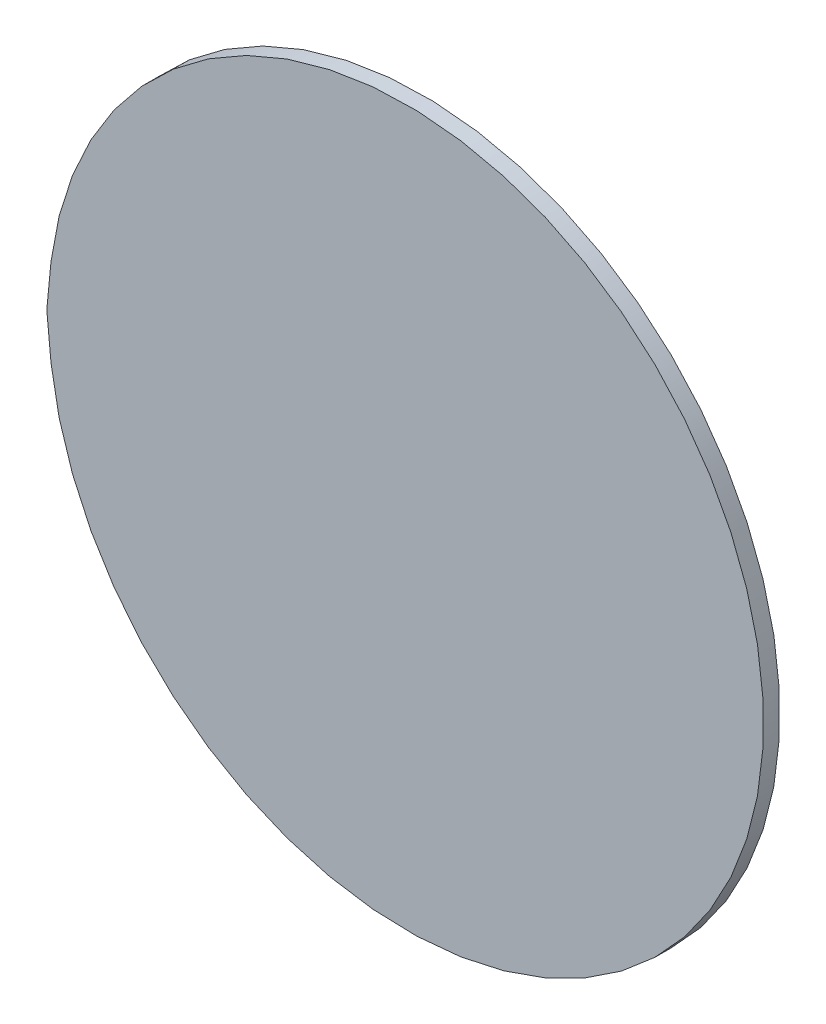
ISO-10303-21;
HEADER;
FILE_DESCRIPTION(('STEP AP214'),'2;1');
FILE_NAME('part.step','',(''),(''),'','','');
FILE_SCHEMA(('AUTOMOTIVE_DESIGN { 1 0 10303 214 1 1 1 1 }'));
ENDSEC;
DATA;
#1=APPLICATION_CONTEXT('core data for automotive mechanical design processes');
#2=APPLICATION_PROTOCOL_DEFINITION('international standard','automotive_design',2000,#1);
#3=PRODUCT_CONTEXT('',#1,'mechanical');
#4=PRODUCT('Part','Part','',(#3));
#5=PRODUCT_RELATED_PRODUCT_CATEGORY('part','',(#4));
#6=PRODUCT_DEFINITION_FORMATION('','',#4);
#7=PRODUCT_DEFINITION_CONTEXT('part definition',#1,'design');
#8=PRODUCT_DEFINITION('design','',#6,#7);
#9=PRODUCT_DEFINITION_SHAPE('','',#8);
#10=(LENGTH_UNIT() NAMED_UNIT(*) SI_UNIT(.MILLI.,.METRE.));
#11=(NAMED_UNIT(*) PLANE_ANGLE_UNIT() SI_UNIT($,.RADIAN.));
#12=(NAMED_UNIT(*) SI_UNIT($,.STERADIAN.) SOLID_ANGLE_UNIT());
#13=UNCERTAINTY_MEASURE_WITH_UNIT(LENGTH_MEASURE(1.E-05),#10,'distance_accuracy_value','');
#14=(GEOMETRIC_REPRESENTATION_CONTEXT(3) GLOBAL_UNCERTAINTY_ASSIGNED_CONTEXT((#13)) GLOBAL_UNIT_ASSIGNED_CONTEXT((#10,
#11,#12)) REPRESENTATION_CONTEXT('',''));
#15=CARTESIAN_POINT('',(0.,0.,0.));
#16=DIRECTION('',(0.,0.,1.));
#17=DIRECTION('',(1.,0.,0.));
#18=AXIS2_PLACEMENT_3D('',#15,#16,#17);
#19=CARTESIAN_POINT('',(-0.449,0.975,1.448));
#20=DIRECTION('',(0.,0.,1.));
#21=DIRECTION('',(1.,0.,0.));
#22=AXIS2_PLACEMENT_3D('',#19,#20,#21);
#23=CYLINDRICAL_SURFACE('',#22,0.043815);
#24=CARTESIAN_POINT('',(-0.449,0.975,1.45));
#25=DIRECTION('',(0.,0.,1.));
#26=DIRECTION('',(1.,0.,0.));
#27=AXIS2_PLACEMENT_3D('',#24,#25,#26);
#28=CIRCLE('',#27,0.043815);
#29=CARTESIAN_POINT('',(-0.493,0.975,1.45));
#30=VERTEX_POINT('',#29);
#31=EDGE_CURVE('E11',#30,#30,#28,.T.);
#32=ORIENTED_EDGE('',*,*,#31,.F.);
#33=CARTESIAN_POINT('',(-0.492815,0.975,1.448));
#34=CARTESIAN_POINT('',(-0.492815,0.975,1.45));
#35=B_SPLINE_CURVE_WITH_KNOTS('',1,(#33,#34),.UNSPECIFIED.,.F.,.F.,(2,2),(0.,0.002),.UNSPECIFIED.);
#36=CARTESIAN_POINT('',(-0.493,0.975,1.448));
#37=VERTEX_POINT('',#36);
#38=EDGE_CURVE('E24',#37,#30,#35,.T.);
#39=ORIENTED_EDGE('',*,*,#38,.F.);
#40=CARTESIAN_POINT('',(-0.449,0.975,1.448));
#41=DIRECTION('',(0.,0.,-1.));
#42=DIRECTION('',(1.,0.,0.));
#43=AXIS2_PLACEMENT_3D('',#40,#41,#42);
#44=CIRCLE('',#43,0.043815);
#45=EDGE_CURVE('E33',#37,#37,#44,.T.);
#46=ORIENTED_EDGE('',*,*,#45,.F.);
#47=ORIENTED_EDGE('',*,*,#38,.T.);
#48=EDGE_LOOP('',(#32,#39,#46,#47));
#49=FACE_BOUND('',#48,.T.);
#50=ADVANCED_FACE('F17',(#49),#23,.T.);
#51=CARTESIAN_POINT('',(-0.449,0.975,1.448));
#52=DIRECTION('',(0.,0.,1.));
#53=DIRECTION('',(0.,1.,0.));
#54=AXIS2_PLACEMENT_3D('',#51,#52,#53);
#55=PLANE('',#54);
#56=ORIENTED_EDGE('',*,*,#45,.T.);
#57=EDGE_LOOP('',(#56));
#58=FACE_BOUND('',#57,.T.);
#59=ADVANCED_FACE('F36',(#58),#55,.F.);
#60=CARTESIAN_POINT('',(-0.449,0.975,1.45));
#61=DIRECTION('',(0.,0.,1.));
#62=DIRECTION('',(0.,1.,0.));
#63=AXIS2_PLACEMENT_3D('',#60,#61,#62);
#64=PLANE('',#63);
#65=ORIENTED_EDGE('',*,*,#31,.T.);
#66=EDGE_LOOP('',(#65));
#67=FACE_BOUND('',#66,.T.);
#68=ADVANCED_FACE('F49',(#67),#64,.T.);
#69=CLOSED_SHELL('',(#50,#59,#68));
#70=MANIFOLD_SOLID_BREP('B1',#69);
#71=ADVANCED_BREP_SHAPE_REPRESENTATION('',(#18,#70),#14);
#72=SHAPE_DEFINITION_REPRESENTATION(#9,#71);
ENDSEC;
END-ISO-10303-21;
